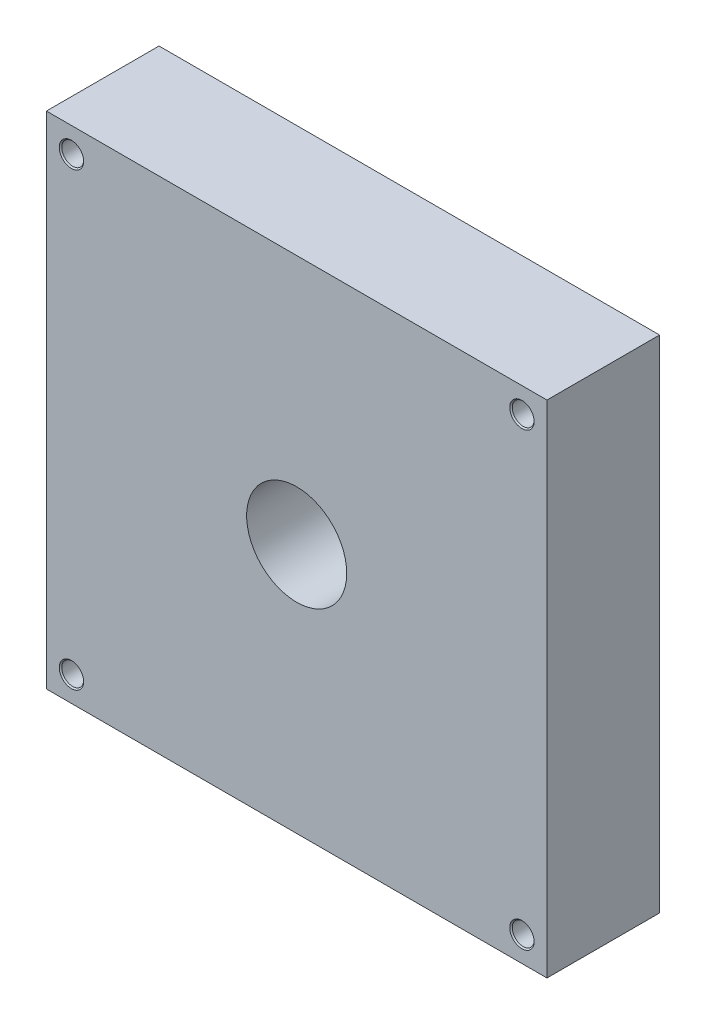
ISO-10303-21;
HEADER;
FILE_DESCRIPTION(('STEP AP214'),'2;1');
FILE_NAME('part.step','',(''),(''),'','','');
FILE_SCHEMA(('AUTOMOTIVE_DESIGN { 1 0 10303 214 1 1 1 1 }'));
ENDSEC;
DATA;
#1=APPLICATION_CONTEXT('core data for automotive mechanical design processes');
#2=APPLICATION_PROTOCOL_DEFINITION('international standard','automotive_design',2000,#1);
#3=PRODUCT_CONTEXT('',#1,'mechanical');
#4=PRODUCT('Part','Part','',(#3));
#5=PRODUCT_RELATED_PRODUCT_CATEGORY('part','',(#4));
#6=PRODUCT_DEFINITION_FORMATION('','',#4);
#7=PRODUCT_DEFINITION_CONTEXT('part definition',#1,'design');
#8=PRODUCT_DEFINITION('design','',#6,#7);
#9=PRODUCT_DEFINITION_SHAPE('','',#8);
#10=(LENGTH_UNIT() NAMED_UNIT(*) SI_UNIT(.MILLI.,.METRE.));
#11=(NAMED_UNIT(*) PLANE_ANGLE_UNIT() SI_UNIT($,.RADIAN.));
#12=(NAMED_UNIT(*) SI_UNIT($,.STERADIAN.) SOLID_ANGLE_UNIT());
#13=UNCERTAINTY_MEASURE_WITH_UNIT(LENGTH_MEASURE(1.E-05),#10,'distance_accuracy_value','');
#14=(GEOMETRIC_REPRESENTATION_CONTEXT(3) GLOBAL_UNCERTAINTY_ASSIGNED_CONTEXT((#13)) GLOBAL_UNIT_ASSIGNED_CONTEXT((#10,
#11,#12)) REPRESENTATION_CONTEXT('',''));
#15=CARTESIAN_POINT('',(0.,0.,0.));
#16=DIRECTION('',(0.,0.,1.));
#17=DIRECTION('',(1.,0.,0.));
#18=AXIS2_PLACEMENT_3D('',#15,#16,#17);
#19=CARTESIAN_POINT('',(-127.,0.,-57.15));
#20=DIRECTION('',(-1.,0.,0.));
#21=DIRECTION('',(0.,-1.,0.));
#22=AXIS2_PLACEMENT_3D('',#19,#20,#21);
#23=PLANE('',#22);
#24=DIRECTION('',(0.,-1.,0.));
#25=VECTOR('',#24,1.);
#26=CARTESIAN_POINT('',(-127.,0.,0.));
#27=LINE('',#26,#25);
#28=CARTESIAN_POINT('',(-127.,127.,0.));
#29=VERTEX_POINT('',#28);
#30=CARTESIAN_POINT('',(-127.,-127.,0.));
#31=VERTEX_POINT('',#30);
#32=EDGE_CURVE('E198',#29,#31,#27,.T.);
#33=ORIENTED_EDGE('',*,*,#32,.F.);
#34=DIRECTION('',(0.,0.,1.));
#35=VECTOR('',#34,1.);
#36=CARTESIAN_POINT('',(-127.,127.,-57.15));
#37=LINE('',#36,#35);
#38=CARTESIAN_POINT('',(-127.,127.,-57.15));
#39=VERTEX_POINT('',#38);
#40=EDGE_CURVE('E11',#39,#29,#37,.T.);
#41=ORIENTED_EDGE('',*,*,#40,.F.);
#42=DIRECTION('',(0.,-1.,0.));
#43=VECTOR('',#42,1.);
#44=CARTESIAN_POINT('',(-127.,0.,-57.15));
#45=LINE('',#44,#43);
#46=CARTESIAN_POINT('',(-127.,-127.,-57.15));
#47=VERTEX_POINT('',#46);
#48=EDGE_CURVE('E199',#39,#47,#45,.T.);
#49=ORIENTED_EDGE('',*,*,#48,.T.);
#50=DIRECTION('',(0.,0.,1.));
#51=VECTOR('',#50,1.);
#52=CARTESIAN_POINT('',(-127.,-127.,-57.15));
#53=LINE('',#52,#51);
#54=EDGE_CURVE('E39',#47,#31,#53,.T.);
#55=ORIENTED_EDGE('',*,*,#54,.T.);
#56=EDGE_LOOP('',(#33,#41,#49,#55));
#57=FACE_BOUND('',#56,.T.);
#58=ADVANCED_FACE('F36',(#57),#23,.T.);
#59=CARTESIAN_POINT('',(0.,127.,-57.15));
#60=DIRECTION('',(0.,1.,0.));
#61=DIRECTION('',(-1.,0.,0.));
#62=AXIS2_PLACEMENT_3D('',#59,#60,#61);
#63=PLANE('',#62);
#64=DIRECTION('',(-1.,0.,0.));
#65=VECTOR('',#64,1.);
#66=CARTESIAN_POINT('',(0.,127.,0.));
#67=LINE('',#66,#65);
#68=CARTESIAN_POINT('',(127.,127.,0.));
#69=VERTEX_POINT('',#68);
#70=EDGE_CURVE('E217',#69,#29,#67,.T.);
#71=ORIENTED_EDGE('',*,*,#70,.F.);
#72=DIRECTION('',(0.,0.,1.));
#73=VECTOR('',#72,1.);
#74=CARTESIAN_POINT('',(127.,127.,-57.15));
#75=LINE('',#74,#73);
#76=CARTESIAN_POINT('',(127.,127.,-57.15));
#77=VERTEX_POINT('',#76);
#78=EDGE_CURVE('E45',#77,#69,#75,.T.);
#79=ORIENTED_EDGE('',*,*,#78,.F.);
#80=DIRECTION('',(-1.,0.,0.));
#81=VECTOR('',#80,1.);
#82=CARTESIAN_POINT('',(0.,127.,-57.15));
#83=LINE('',#82,#81);
#84=EDGE_CURVE('E205',#77,#39,#83,.T.);
#85=ORIENTED_EDGE('',*,*,#84,.T.);
#86=ORIENTED_EDGE('',*,*,#40,.T.);
#87=EDGE_LOOP('',(#71,#79,#85,#86));
#88=FACE_BOUND('',#87,.T.);
#89=ADVANCED_FACE('F231',(#88),#63,.T.);
#90=CARTESIAN_POINT('',(127.,0.,-57.15));
#91=DIRECTION('',(-1.,0.,0.));
#92=DIRECTION('',(0.,-1.,0.));
#93=AXIS2_PLACEMENT_3D('',#90,#91,#92);
#94=PLANE('',#93);
#95=DIRECTION('',(0.,-1.,0.));
#96=VECTOR('',#95,1.);
#97=CARTESIAN_POINT('',(127.,0.,0.));
#98=LINE('',#97,#96);
#99=CARTESIAN_POINT('',(127.,-127.,0.));
#100=VERTEX_POINT('',#99);
#101=EDGE_CURVE('E215',#69,#100,#98,.T.);
#102=ORIENTED_EDGE('',*,*,#101,.T.);
#103=DIRECTION('',(0.,0.,1.));
#104=VECTOR('',#103,1.);
#105=CARTESIAN_POINT('',(127.,-127.,-57.15));
#106=LINE('',#105,#104);
#107=CARTESIAN_POINT('',(127.,-127.,-57.15));
#108=VERTEX_POINT('',#107);
#109=EDGE_CURVE('E222',#108,#100,#106,.T.);
#110=ORIENTED_EDGE('',*,*,#109,.F.);
#111=DIRECTION('',(0.,-1.,0.));
#112=VECTOR('',#111,1.);
#113=CARTESIAN_POINT('',(127.,0.,-57.15));
#114=LINE('',#113,#112);
#115=EDGE_CURVE('E203',#77,#108,#114,.T.);
#116=ORIENTED_EDGE('',*,*,#115,.F.);
#117=ORIENTED_EDGE('',*,*,#78,.T.);
#118=EDGE_LOOP('',(#102,#110,#116,#117));
#119=FACE_BOUND('',#118,.T.);
#120=ADVANCED_FACE('F233',(#119),#94,.F.);
#121=CARTESIAN_POINT('',(0.,-127.,-57.15));
#122=DIRECTION('',(0.,1.,0.));
#123=DIRECTION('',(-1.,0.,0.));
#124=AXIS2_PLACEMENT_3D('',#121,#122,#123);
#125=PLANE('',#124);
#126=CARTESIAN_POINT('',(-3.17499999999994,-127.,-25.4));
#127=DIRECTION('',(0.,-1.,0.));
#128=DIRECTION('',(0.,0.,-1.));
#129=AXIS2_PLACEMENT_3D('',#126,#127,#128);
#130=CIRCLE('',#129,2.01929999999999);
#131=CARTESIAN_POINT('',(-3.17499999999994,-127.,-27.4193));
#132=VERTEX_POINT('',#131);
#133=EDGE_CURVE('E104',#132,#132,#130,.T.);
#134=ORIENTED_EDGE('',*,*,#133,.F.);
#135=EDGE_LOOP('',(#134));
#136=FACE_BOUND('',#135,.T.);
#137=CARTESIAN_POINT('',(9.52500000000006,-127.,-25.4));
#138=DIRECTION('',(0.,-1.,0.));
#139=DIRECTION('',(0.,0.,-1.));
#140=AXIS2_PLACEMENT_3D('',#137,#138,#139);
#141=CIRCLE('',#140,2.01929999999999);
#142=CARTESIAN_POINT('',(9.52500000000006,-127.,-27.4193));
#143=VERTEX_POINT('',#142);
#144=EDGE_CURVE('E103',#143,#143,#141,.T.);
#145=ORIENTED_EDGE('',*,*,#144,.F.);
#146=EDGE_LOOP('',(#145));
#147=FACE_BOUND('',#146,.T.);
#148=CARTESIAN_POINT('',(-36.9999999999999,-127.,-14.2875));
#149=DIRECTION('',(0.,-1.,0.));
#150=DIRECTION('',(0.,0.,-1.));
#151=AXIS2_PLACEMENT_3D('',#148,#149,#150);
#152=CIRCLE('',#151,2.01929999999999);
#153=CARTESIAN_POINT('',(-36.9999999999999,-127.,-16.3068));
#154=VERTEX_POINT('',#153);
#155=EDGE_CURVE('E114',#154,#154,#152,.T.);
#156=ORIENTED_EDGE('',*,*,#155,.F.);
#157=EDGE_LOOP('',(#156));
#158=FACE_BOUND('',#157,.T.);
#159=CARTESIAN_POINT('',(-36.9999999999999,-127.,-36.5125));
#160=DIRECTION('',(0.,-1.,0.));
#161=DIRECTION('',(0.,0.,-1.));
#162=AXIS2_PLACEMENT_3D('',#159,#160,#161);
#163=CIRCLE('',#162,2.01929999999999);
#164=CARTESIAN_POINT('',(-36.9999999999999,-127.,-38.5318));
#165=VERTEX_POINT('',#164);
#166=EDGE_CURVE('E120',#165,#165,#163,.T.);
#167=ORIENTED_EDGE('',*,*,#166,.F.);
#168=EDGE_LOOP('',(#167));
#169=FACE_BOUND('',#168,.T.);
#170=DIRECTION('',(-1.,0.,0.));
#171=VECTOR('',#170,1.);
#172=CARTESIAN_POINT('',(0.,-127.,0.));
#173=LINE('',#172,#171);
#174=EDGE_CURVE('E212',#100,#31,#173,.T.);
#175=ORIENTED_EDGE('',*,*,#174,.T.);
#176=ORIENTED_EDGE('',*,*,#54,.F.);
#177=DIRECTION('',(-1.,0.,0.));
#178=VECTOR('',#177,1.);
#179=CARTESIAN_POINT('',(0.,-127.,-57.15));
#180=LINE('',#179,#178);
#181=EDGE_CURVE('E79',#108,#47,#180,.T.);
#182=ORIENTED_EDGE('',*,*,#181,.F.);
#183=ORIENTED_EDGE('',*,*,#109,.T.);
#184=EDGE_LOOP('',(#175,#176,#182,#183));
#185=FACE_BOUND('',#184,.T.);
#186=ADVANCED_FACE('F227',(#136,#147,#158,#169,#185),#125,.F.);
#187=CARTESIAN_POINT('',(0.,0.,-57.15));
#188=DIRECTION('',(0.,0.,1.));
#189=DIRECTION('',(1.,0.,0.));
#190=AXIS2_PLACEMENT_3D('',#187,#188,#189);
#191=CYLINDRICAL_SURFACE('',#190,25.4);
#192=CARTESIAN_POINT('',(0.,0.,-57.15));
#193=DIRECTION('',(0.,0.,1.));
#194=DIRECTION('',(1.,0.,0.));
#195=AXIS2_PLACEMENT_3D('',#192,#193,#194);
#196=CIRCLE('',#195,25.4);
#197=CARTESIAN_POINT('',(25.4,0.,-57.15));
#198=VERTEX_POINT('',#197);
#199=EDGE_CURVE('E207',#198,#198,#196,.T.);
#200=ORIENTED_EDGE('',*,*,#199,.F.);
#201=EDGE_LOOP('',(#200));
#202=FACE_BOUND('',#201,.T.);
#203=CARTESIAN_POINT('',(0.,0.,0.));
#204=DIRECTION('',(0.,0.,1.));
#205=DIRECTION('',(1.,0.,0.));
#206=AXIS2_PLACEMENT_3D('',#203,#204,#205);
#207=CIRCLE('',#206,25.4);
#208=CARTESIAN_POINT('',(25.4,0.,0.));
#209=VERTEX_POINT('',#208);
#210=EDGE_CURVE('E201',#209,#209,#207,.T.);
#211=ORIENTED_EDGE('',*,*,#210,.T.);
#212=EDGE_LOOP('',(#211));
#213=FACE_BOUND('',#212,.T.);
#214=ADVANCED_FACE('F237',(#202,#213),#191,.F.);
#215=CARTESIAN_POINT('',(0.,0.,-57.15));
#216=DIRECTION('',(0.,0.,1.));
#217=DIRECTION('',(1.,0.,0.));
#218=AXIS2_PLACEMENT_3D('',#215,#216,#217);
#219=PLANE('',#218);
#220=CARTESIAN_POINT('',(-114.3,114.3,-57.15));
#221=DIRECTION('',(0.,0.,1.));
#222=DIRECTION('',(1.,0.,0.));
#223=AXIS2_PLACEMENT_3D('',#220,#221,#222);
#224=CIRCLE('',#223,3.89889999999998);
#225=CARTESIAN_POINT('',(-110.4011,114.3,-57.15));
#226=VERTEX_POINT('',#225);
#227=EDGE_CURVE('E126',#226,#226,#224,.T.);
#228=ORIENTED_EDGE('',*,*,#227,.T.);
#229=EDGE_LOOP('',(#228));
#230=FACE_BOUND('',#229,.T.);
#231=CARTESIAN_POINT('',(114.3,114.3,-57.15));
#232=DIRECTION('',(0.,0.,1.));
#233=DIRECTION('',(1.,0.,0.));
#234=AXIS2_PLACEMENT_3D('',#231,#232,#233);
#235=CIRCLE('',#234,3.89889999999998);
#236=CARTESIAN_POINT('',(118.1989,114.3,-57.15));
#237=VERTEX_POINT('',#236);
#238=EDGE_CURVE('E144',#237,#237,#235,.T.);
#239=ORIENTED_EDGE('',*,*,#238,.T.);
#240=EDGE_LOOP('',(#239));
#241=FACE_BOUND('',#240,.T.);
#242=CARTESIAN_POINT('',(114.3,-114.3,-57.15));
#243=DIRECTION('',(0.,0.,1.));
#244=DIRECTION('',(1.,0.,0.));
#245=AXIS2_PLACEMENT_3D('',#242,#243,#244);
#246=CIRCLE('',#245,3.89889999999998);
#247=CARTESIAN_POINT('',(118.1989,-114.3,-57.15));
#248=VERTEX_POINT('',#247);
#249=EDGE_CURVE('E162',#248,#248,#246,.T.);
#250=ORIENTED_EDGE('',*,*,#249,.T.);
#251=EDGE_LOOP('',(#250));
#252=FACE_BOUND('',#251,.T.);
#253=CARTESIAN_POINT('',(-114.3,-114.3,-57.15));
#254=DIRECTION('',(0.,0.,1.));
#255=DIRECTION('',(1.,0.,0.));
#256=AXIS2_PLACEMENT_3D('',#253,#254,#255);
#257=CIRCLE('',#256,3.89889999999998);
#258=CARTESIAN_POINT('',(-110.4011,-114.3,-57.15));
#259=VERTEX_POINT('',#258);
#260=EDGE_CURVE('E180',#259,#259,#257,.T.);
#261=ORIENTED_EDGE('',*,*,#260,.T.);
#262=EDGE_LOOP('',(#261));
#263=FACE_BOUND('',#262,.T.);
#264=ORIENTED_EDGE('',*,*,#48,.F.);
#265=ORIENTED_EDGE('',*,*,#84,.F.);
#266=ORIENTED_EDGE('',*,*,#115,.T.);
#267=ORIENTED_EDGE('',*,*,#181,.T.);
#268=EDGE_LOOP('',(#264,#265,#266,#267));
#269=FACE_BOUND('',#268,.T.);
#270=ORIENTED_EDGE('',*,*,#199,.T.);
#271=EDGE_LOOP('',(#270));
#272=FACE_BOUND('',#271,.T.);
#273=ADVANCED_FACE('F234',(#230,#241,#252,#263,#269,#272),#219,.F.);
#274=CARTESIAN_POINT('',(0.,0.,0.));
#275=DIRECTION('',(0.,0.,1.));
#276=DIRECTION('',(1.,0.,0.));
#277=AXIS2_PLACEMENT_3D('',#274,#275,#276);
#278=PLANE('',#277);
#279=CARTESIAN_POINT('',(-114.3,114.3,0.));
#280=DIRECTION('',(0.,0.,1.));
#281=DIRECTION('',(1.,0.,0.));
#282=AXIS2_PLACEMENT_3D('',#279,#280,#281);
#283=CIRCLE('',#282,6.19125);
#284=CARTESIAN_POINT('',(-108.10875,114.3,0.));
#285=VERTEX_POINT('',#284);
#286=EDGE_CURVE('E129',#285,#285,#283,.T.);
#287=ORIENTED_EDGE('',*,*,#286,.F.);
#288=EDGE_LOOP('',(#287));
#289=FACE_BOUND('',#288,.T.);
#290=CARTESIAN_POINT('',(114.3,114.3,0.));
#291=DIRECTION('',(0.,0.,1.));
#292=DIRECTION('',(1.,0.,0.));
#293=AXIS2_PLACEMENT_3D('',#290,#291,#292);
#294=CIRCLE('',#293,6.19125);
#295=CARTESIAN_POINT('',(120.49125,114.3,0.));
#296=VERTEX_POINT('',#295);
#297=EDGE_CURVE('E147',#296,#296,#294,.T.);
#298=ORIENTED_EDGE('',*,*,#297,.F.);
#299=EDGE_LOOP('',(#298));
#300=FACE_BOUND('',#299,.T.);
#301=CARTESIAN_POINT('',(114.3,-114.3,0.));
#302=DIRECTION('',(0.,0.,1.));
#303=DIRECTION('',(1.,0.,0.));
#304=AXIS2_PLACEMENT_3D('',#301,#302,#303);
#305=CIRCLE('',#304,6.19125);
#306=CARTESIAN_POINT('',(120.49125,-114.3,0.));
#307=VERTEX_POINT('',#306);
#308=EDGE_CURVE('E165',#307,#307,#305,.T.);
#309=ORIENTED_EDGE('',*,*,#308,.F.);
#310=EDGE_LOOP('',(#309));
#311=FACE_BOUND('',#310,.T.);
#312=CARTESIAN_POINT('',(-114.3,-114.3,0.));
#313=DIRECTION('',(0.,0.,1.));
#314=DIRECTION('',(1.,0.,0.));
#315=AXIS2_PLACEMENT_3D('',#312,#313,#314);
#316=CIRCLE('',#315,6.19125);
#317=CARTESIAN_POINT('',(-108.10875,-114.3,0.));
#318=VERTEX_POINT('',#317);
#319=EDGE_CURVE('E183',#318,#318,#316,.T.);
#320=ORIENTED_EDGE('',*,*,#319,.F.);
#321=EDGE_LOOP('',(#320));
#322=FACE_BOUND('',#321,.T.);
#323=ORIENTED_EDGE('',*,*,#32,.T.);
#324=ORIENTED_EDGE('',*,*,#174,.F.);
#325=ORIENTED_EDGE('',*,*,#101,.F.);
#326=ORIENTED_EDGE('',*,*,#70,.T.);
#327=EDGE_LOOP('',(#323,#324,#325,#326));
#328=FACE_BOUND('',#327,.T.);
#329=ORIENTED_EDGE('',*,*,#210,.F.);
#330=EDGE_LOOP('',(#329));
#331=FACE_BOUND('',#330,.T.);
#332=ADVANCED_FACE('F229',(#289,#300,#311,#322,#328,#331),#278,.T.);
#333=CARTESIAN_POINT('',(-114.3,-114.3,-56.515));
#334=DIRECTION('',(0.,0.,-1.));
#335=DIRECTION('',(-1.,0.,0.));
#336=AXIS2_PLACEMENT_3D('',#333,#334,#335);
#337=CONICAL_SURFACE('',#336,3.26389999999999,0.785398163397454);
#338=ORIENTED_EDGE('',*,*,#260,.F.);
#339=EDGE_LOOP('',(#338));
#340=FACE_BOUND('',#339,.T.);
#341=CARTESIAN_POINT('',(-114.3,-114.3,-56.515));
#342=DIRECTION('',(0.,0.,1.));
#343=DIRECTION('',(1.,0.,0.));
#344=AXIS2_PLACEMENT_3D('',#341,#342,#343);
#345=CIRCLE('',#344,3.26389999999999);
#346=CARTESIAN_POINT('',(-111.0361,-114.3,-56.515));
#347=VERTEX_POINT('',#346);
#348=EDGE_CURVE('E195',#347,#347,#345,.T.);
#349=ORIENTED_EDGE('',*,*,#348,.T.);
#350=EDGE_LOOP('',(#349));
#351=FACE_BOUND('',#350,.T.);
#352=ADVANCED_FACE('F247',(#340,#351),#337,.F.);
#353=CARTESIAN_POINT('',(-114.3,-114.3,0.));
#354=DIRECTION('',(0.,0.,1.));
#355=DIRECTION('',(1.,0.,0.));
#356=AXIS2_PLACEMENT_3D('',#353,#354,#355);
#357=CYLINDRICAL_SURFACE('',#356,3.26389999999999);
#358=ORIENTED_EDGE('',*,*,#348,.F.);
#359=EDGE_LOOP('',(#358));
#360=FACE_BOUND('',#359,.T.);
#361=CARTESIAN_POINT('',(-114.3,-114.3,-50.8));
#362=DIRECTION('',(0.,0.,1.));
#363=DIRECTION('',(1.,0.,0.));
#364=AXIS2_PLACEMENT_3D('',#361,#362,#363);
#365=CIRCLE('',#364,3.26389999999999);
#366=CARTESIAN_POINT('',(-111.0361,-114.3,-50.8));
#367=VERTEX_POINT('',#366);
#368=EDGE_CURVE('E192',#367,#367,#365,.T.);
#369=ORIENTED_EDGE('',*,*,#368,.T.);
#370=EDGE_LOOP('',(#369));
#371=FACE_BOUND('',#370,.T.);
#372=ADVANCED_FACE('F253',(#360,#371),#357,.F.);
#373=CARTESIAN_POINT('',(-108.74375,-114.3,-50.8));
#374=DIRECTION('',(0.,0.,-1.));
#375=DIRECTION('',(-1.,0.,0.));
#376=AXIS2_PLACEMENT_3D('',#373,#374,#375);
#377=PLANE('',#376);
#378=ORIENTED_EDGE('',*,*,#368,.F.);
#379=EDGE_LOOP('',(#378));
#380=FACE_BOUND('',#379,.T.);
#381=CARTESIAN_POINT('',(-114.3,-114.3,-50.8));
#382=DIRECTION('',(0.,0.,1.));
#383=DIRECTION('',(1.,0.,0.));
#384=AXIS2_PLACEMENT_3D('',#381,#382,#383);
#385=CIRCLE('',#384,5.55624999999998);
#386=CARTESIAN_POINT('',(-108.74375,-114.3,-50.8));
#387=VERTEX_POINT('',#386);
#388=EDGE_CURVE('E189',#387,#387,#385,.T.);
#389=ORIENTED_EDGE('',*,*,#388,.T.);
#390=EDGE_LOOP('',(#389));
#391=FACE_BOUND('',#390,.T.);
#392=ADVANCED_FACE('F364',(#380,#391),#377,.F.);
#393=CARTESIAN_POINT('',(-114.3,-114.3,0.));
#394=DIRECTION('',(0.,0.,1.));
#395=DIRECTION('',(1.,0.,0.));
#396=AXIS2_PLACEMENT_3D('',#393,#394,#395);
#397=CYLINDRICAL_SURFACE('',#396,5.55624999999999);
#398=ORIENTED_EDGE('',*,*,#388,.F.);
#399=EDGE_LOOP('',(#398));
#400=FACE_BOUND('',#399,.T.);
#401=CARTESIAN_POINT('',(-114.3,-114.3,-0.635));
#402=DIRECTION('',(0.,0.,1.));
#403=DIRECTION('',(1.,0.,0.));
#404=AXIS2_PLACEMENT_3D('',#401,#402,#403);
#405=CIRCLE('',#404,5.55625);
#406=CARTESIAN_POINT('',(-108.74375,-114.3,-0.635));
#407=VERTEX_POINT('',#406);
#408=EDGE_CURVE('E186',#407,#407,#405,.T.);
#409=ORIENTED_EDGE('',*,*,#408,.T.);
#410=EDGE_LOOP('',(#409));
#411=FACE_BOUND('',#410,.T.);
#412=ADVANCED_FACE('F360',(#400,#411),#397,.F.);
#413=CARTESIAN_POINT('',(-114.3,-114.3,0.));
#414=DIRECTION('',(0.,0.,1.));
#415=DIRECTION('',(1.,0.,0.));
#416=AXIS2_PLACEMENT_3D('',#413,#414,#415);
#417=CONICAL_SURFACE('',#416,6.19125,0.785398163397445);
#418=ORIENTED_EDGE('',*,*,#408,.F.);
#419=EDGE_LOOP('',(#418));
#420=FACE_BOUND('',#419,.T.);
#421=ORIENTED_EDGE('',*,*,#319,.T.);
#422=EDGE_LOOP('',(#421));
#423=FACE_BOUND('',#422,.T.);
#424=ADVANCED_FACE('F356',(#420,#423),#417,.F.);
#425=CARTESIAN_POINT('',(114.3,-114.3,-56.515));
#426=DIRECTION('',(0.,0.,-1.));
#427=DIRECTION('',(-1.,0.,0.));
#428=AXIS2_PLACEMENT_3D('',#425,#426,#427);
#429=CONICAL_SURFACE('',#428,3.26389999999999,0.785398163397454);
#430=ORIENTED_EDGE('',*,*,#249,.F.);
#431=EDGE_LOOP('',(#430));
#432=FACE_BOUND('',#431,.T.);
#433=CARTESIAN_POINT('',(114.3,-114.3,-56.515));
#434=DIRECTION('',(0.,0.,1.));
#435=DIRECTION('',(1.,0.,0.));
#436=AXIS2_PLACEMENT_3D('',#433,#434,#435);
#437=CIRCLE('',#436,3.26389999999999);
#438=CARTESIAN_POINT('',(117.5639,-114.3,-56.515));
#439=VERTEX_POINT('',#438);
#440=EDGE_CURVE('E177',#439,#439,#437,.T.);
#441=ORIENTED_EDGE('',*,*,#440,.T.);
#442=EDGE_LOOP('',(#441));
#443=FACE_BOUND('',#442,.T.);
#444=ADVANCED_FACE('F352',(#432,#443),#429,.F.);
#445=CARTESIAN_POINT('',(114.3,-114.3,0.));
#446=DIRECTION('',(0.,0.,1.));
#447=DIRECTION('',(1.,0.,0.));
#448=AXIS2_PLACEMENT_3D('',#445,#446,#447);
#449=CYLINDRICAL_SURFACE('',#448,3.26389999999999);
#450=ORIENTED_EDGE('',*,*,#440,.F.);
#451=EDGE_LOOP('',(#450));
#452=FACE_BOUND('',#451,.T.);
#453=CARTESIAN_POINT('',(114.3,-114.3,-50.8));
#454=DIRECTION('',(0.,0.,1.));
#455=DIRECTION('',(1.,0.,0.));
#456=AXIS2_PLACEMENT_3D('',#453,#454,#455);
#457=CIRCLE('',#456,3.26389999999999);
#458=CARTESIAN_POINT('',(117.5639,-114.3,-50.8));
#459=VERTEX_POINT('',#458);
#460=EDGE_CURVE('E174',#459,#459,#457,.T.);
#461=ORIENTED_EDGE('',*,*,#460,.T.);
#462=EDGE_LOOP('',(#461));
#463=FACE_BOUND('',#462,.T.);
#464=ADVANCED_FACE('F348',(#452,#463),#449,.F.);
#465=CARTESIAN_POINT('',(119.85625,-114.3,-50.8));
#466=DIRECTION('',(0.,0.,-1.));
#467=DIRECTION('',(-1.,0.,0.));
#468=AXIS2_PLACEMENT_3D('',#465,#466,#467);
#469=PLANE('',#468);
#470=ORIENTED_EDGE('',*,*,#460,.F.);
#471=EDGE_LOOP('',(#470));
#472=FACE_BOUND('',#471,.T.);
#473=CARTESIAN_POINT('',(114.3,-114.3,-50.8));
#474=DIRECTION('',(0.,0.,1.));
#475=DIRECTION('',(1.,0.,0.));
#476=AXIS2_PLACEMENT_3D('',#473,#474,#475);
#477=CIRCLE('',#476,5.55624999999998);
#478=CARTESIAN_POINT('',(119.85625,-114.3,-50.8));
#479=VERTEX_POINT('',#478);
#480=EDGE_CURVE('E171',#479,#479,#477,.T.);
#481=ORIENTED_EDGE('',*,*,#480,.T.);
#482=EDGE_LOOP('',(#481));
#483=FACE_BOUND('',#482,.T.);
#484=ADVANCED_FACE('F344',(#472,#483),#469,.F.);
#485=CARTESIAN_POINT('',(114.3,-114.3,0.));
#486=DIRECTION('',(0.,0.,1.));
#487=DIRECTION('',(1.,0.,0.));
#488=AXIS2_PLACEMENT_3D('',#485,#486,#487);
#489=CYLINDRICAL_SURFACE('',#488,5.55624999999999);
#490=ORIENTED_EDGE('',*,*,#480,.F.);
#491=EDGE_LOOP('',(#490));
#492=FACE_BOUND('',#491,.T.);
#493=CARTESIAN_POINT('',(114.3,-114.3,-0.635));
#494=DIRECTION('',(0.,0.,1.));
#495=DIRECTION('',(1.,0.,0.));
#496=AXIS2_PLACEMENT_3D('',#493,#494,#495);
#497=CIRCLE('',#496,5.55625);
#498=CARTESIAN_POINT('',(119.85625,-114.3,-0.635));
#499=VERTEX_POINT('',#498);
#500=EDGE_CURVE('E168',#499,#499,#497,.T.);
#501=ORIENTED_EDGE('',*,*,#500,.T.);
#502=EDGE_LOOP('',(#501));
#503=FACE_BOUND('',#502,.T.);
#504=ADVANCED_FACE('F340',(#492,#503),#489,.F.);
#505=CARTESIAN_POINT('',(114.3,-114.3,0.));
#506=DIRECTION('',(0.,0.,1.));
#507=DIRECTION('',(1.,0.,0.));
#508=AXIS2_PLACEMENT_3D('',#505,#506,#507);
#509=CONICAL_SURFACE('',#508,6.19125,0.785398163397445);
#510=ORIENTED_EDGE('',*,*,#500,.F.);
#511=EDGE_LOOP('',(#510));
#512=FACE_BOUND('',#511,.T.);
#513=ORIENTED_EDGE('',*,*,#308,.T.);
#514=EDGE_LOOP('',(#513));
#515=FACE_BOUND('',#514,.T.);
#516=ADVANCED_FACE('F336',(#512,#515),#509,.F.);
#517=CARTESIAN_POINT('',(114.3,114.3,-56.515));
#518=DIRECTION('',(0.,0.,-1.));
#519=DIRECTION('',(-1.,0.,0.));
#520=AXIS2_PLACEMENT_3D('',#517,#518,#519);
#521=CONICAL_SURFACE('',#520,3.26389999999999,0.785398163397454);
#522=ORIENTED_EDGE('',*,*,#238,.F.);
#523=EDGE_LOOP('',(#522));
#524=FACE_BOUND('',#523,.T.);
#525=CARTESIAN_POINT('',(114.3,114.3,-56.515));
#526=DIRECTION('',(0.,0.,1.));
#527=DIRECTION('',(1.,0.,0.));
#528=AXIS2_PLACEMENT_3D('',#525,#526,#527);
#529=CIRCLE('',#528,3.26389999999999);
#530=CARTESIAN_POINT('',(117.5639,114.3,-56.515));
#531=VERTEX_POINT('',#530);
#532=EDGE_CURVE('E159',#531,#531,#529,.T.);
#533=ORIENTED_EDGE('',*,*,#532,.T.);
#534=EDGE_LOOP('',(#533));
#535=FACE_BOUND('',#534,.T.);
#536=ADVANCED_FACE('F332',(#524,#535),#521,.F.);
#537=CARTESIAN_POINT('',(114.3,114.3,0.));
#538=DIRECTION('',(0.,0.,1.));
#539=DIRECTION('',(1.,0.,0.));
#540=AXIS2_PLACEMENT_3D('',#537,#538,#539);
#541=CYLINDRICAL_SURFACE('',#540,3.26389999999999);
#542=ORIENTED_EDGE('',*,*,#532,.F.);
#543=EDGE_LOOP('',(#542));
#544=FACE_BOUND('',#543,.T.);
#545=CARTESIAN_POINT('',(114.3,114.3,-50.8));
#546=DIRECTION('',(0.,0.,1.));
#547=DIRECTION('',(1.,0.,0.));
#548=AXIS2_PLACEMENT_3D('',#545,#546,#547);
#549=CIRCLE('',#548,3.26389999999999);
#550=CARTESIAN_POINT('',(117.5639,114.3,-50.8));
#551=VERTEX_POINT('',#550);
#552=EDGE_CURVE('E156',#551,#551,#549,.T.);
#553=ORIENTED_EDGE('',*,*,#552,.T.);
#554=EDGE_LOOP('',(#553));
#555=FACE_BOUND('',#554,.T.);
#556=ADVANCED_FACE('F328',(#544,#555),#541,.F.);
#557=CARTESIAN_POINT('',(119.85625,114.3,-50.8));
#558=DIRECTION('',(0.,0.,-1.));
#559=DIRECTION('',(-1.,0.,0.));
#560=AXIS2_PLACEMENT_3D('',#557,#558,#559);
#561=PLANE('',#560);
#562=ORIENTED_EDGE('',*,*,#552,.F.);
#563=EDGE_LOOP('',(#562));
#564=FACE_BOUND('',#563,.T.);
#565=CARTESIAN_POINT('',(114.3,114.3,-50.8));
#566=DIRECTION('',(0.,0.,1.));
#567=DIRECTION('',(1.,0.,0.));
#568=AXIS2_PLACEMENT_3D('',#565,#566,#567);
#569=CIRCLE('',#568,5.55624999999998);
#570=CARTESIAN_POINT('',(119.85625,114.3,-50.8));
#571=VERTEX_POINT('',#570);
#572=EDGE_CURVE('E153',#571,#571,#569,.T.);
#573=ORIENTED_EDGE('',*,*,#572,.T.);
#574=EDGE_LOOP('',(#573));
#575=FACE_BOUND('',#574,.T.);
#576=ADVANCED_FACE('F324',(#564,#575),#561,.F.);
#577=CARTESIAN_POINT('',(114.3,114.3,0.));
#578=DIRECTION('',(0.,0.,1.));
#579=DIRECTION('',(1.,0.,0.));
#580=AXIS2_PLACEMENT_3D('',#577,#578,#579);
#581=CYLINDRICAL_SURFACE('',#580,5.55624999999999);
#582=ORIENTED_EDGE('',*,*,#572,.F.);
#583=EDGE_LOOP('',(#582));
#584=FACE_BOUND('',#583,.T.);
#585=CARTESIAN_POINT('',(114.3,114.3,-0.635));
#586=DIRECTION('',(0.,0.,1.));
#587=DIRECTION('',(1.,0.,0.));
#588=AXIS2_PLACEMENT_3D('',#585,#586,#587);
#589=CIRCLE('',#588,5.55625);
#590=CARTESIAN_POINT('',(119.85625,114.3,-0.635));
#591=VERTEX_POINT('',#590);
#592=EDGE_CURVE('E150',#591,#591,#589,.T.);
#593=ORIENTED_EDGE('',*,*,#592,.T.);
#594=EDGE_LOOP('',(#593));
#595=FACE_BOUND('',#594,.T.);
#596=ADVANCED_FACE('F320',(#584,#595),#581,.F.);
#597=CARTESIAN_POINT('',(114.3,114.3,0.));
#598=DIRECTION('',(0.,0.,1.));
#599=DIRECTION('',(1.,0.,0.));
#600=AXIS2_PLACEMENT_3D('',#597,#598,#599);
#601=CONICAL_SURFACE('',#600,6.19125,0.785398163397445);
#602=ORIENTED_EDGE('',*,*,#592,.F.);
#603=EDGE_LOOP('',(#602));
#604=FACE_BOUND('',#603,.T.);
#605=ORIENTED_EDGE('',*,*,#297,.T.);
#606=EDGE_LOOP('',(#605));
#607=FACE_BOUND('',#606,.T.);
#608=ADVANCED_FACE('F316',(#604,#607),#601,.F.);
#609=CARTESIAN_POINT('',(-114.3,114.3,-56.515));
#610=DIRECTION('',(0.,0.,-1.));
#611=DIRECTION('',(-1.,0.,0.));
#612=AXIS2_PLACEMENT_3D('',#609,#610,#611);
#613=CONICAL_SURFACE('',#612,3.26389999999999,0.785398163397454);
#614=ORIENTED_EDGE('',*,*,#227,.F.);
#615=EDGE_LOOP('',(#614));
#616=FACE_BOUND('',#615,.T.);
#617=CARTESIAN_POINT('',(-114.3,114.3,-56.515));
#618=DIRECTION('',(0.,0.,1.));
#619=DIRECTION('',(1.,0.,0.));
#620=AXIS2_PLACEMENT_3D('',#617,#618,#619);
#621=CIRCLE('',#620,3.26389999999999);
#622=CARTESIAN_POINT('',(-111.0361,114.3,-56.515));
#623=VERTEX_POINT('',#622);
#624=EDGE_CURVE('E141',#623,#623,#621,.T.);
#625=ORIENTED_EDGE('',*,*,#624,.T.);
#626=EDGE_LOOP('',(#625));
#627=FACE_BOUND('',#626,.T.);
#628=ADVANCED_FACE('F312',(#616,#627),#613,.F.);
#629=CARTESIAN_POINT('',(-114.3,114.3,0.));
#630=DIRECTION('',(0.,0.,1.));
#631=DIRECTION('',(1.,0.,0.));
#632=AXIS2_PLACEMENT_3D('',#629,#630,#631);
#633=CYLINDRICAL_SURFACE('',#632,3.26389999999999);
#634=ORIENTED_EDGE('',*,*,#624,.F.);
#635=EDGE_LOOP('',(#634));
#636=FACE_BOUND('',#635,.T.);
#637=CARTESIAN_POINT('',(-114.3,114.3,-50.8));
#638=DIRECTION('',(0.,0.,1.));
#639=DIRECTION('',(1.,0.,0.));
#640=AXIS2_PLACEMENT_3D('',#637,#638,#639);
#641=CIRCLE('',#640,3.26389999999999);
#642=CARTESIAN_POINT('',(-111.0361,114.3,-50.8));
#643=VERTEX_POINT('',#642);
#644=EDGE_CURVE('E138',#643,#643,#641,.T.);
#645=ORIENTED_EDGE('',*,*,#644,.T.);
#646=EDGE_LOOP('',(#645));
#647=FACE_BOUND('',#646,.T.);
#648=ADVANCED_FACE('F308',(#636,#647),#633,.F.);
#649=CARTESIAN_POINT('',(-108.74375,114.3,-50.8));
#650=DIRECTION('',(0.,0.,-1.));
#651=DIRECTION('',(-1.,0.,0.));
#652=AXIS2_PLACEMENT_3D('',#649,#650,#651);
#653=PLANE('',#652);
#654=ORIENTED_EDGE('',*,*,#644,.F.);
#655=EDGE_LOOP('',(#654));
#656=FACE_BOUND('',#655,.T.);
#657=CARTESIAN_POINT('',(-114.3,114.3,-50.8));
#658=DIRECTION('',(0.,0.,1.));
#659=DIRECTION('',(1.,0.,0.));
#660=AXIS2_PLACEMENT_3D('',#657,#658,#659);
#661=CIRCLE('',#660,5.55624999999998);
#662=CARTESIAN_POINT('',(-108.74375,114.3,-50.8));
#663=VERTEX_POINT('',#662);
#664=EDGE_CURVE('E135',#663,#663,#661,.T.);
#665=ORIENTED_EDGE('',*,*,#664,.T.);
#666=EDGE_LOOP('',(#665));
#667=FACE_BOUND('',#666,.T.);
#668=ADVANCED_FACE('F304',(#656,#667),#653,.F.);
#669=CARTESIAN_POINT('',(-114.3,114.3,0.));
#670=DIRECTION('',(0.,0.,1.));
#671=DIRECTION('',(1.,0.,0.));
#672=AXIS2_PLACEMENT_3D('',#669,#670,#671);
#673=CYLINDRICAL_SURFACE('',#672,5.55624999999999);
#674=ORIENTED_EDGE('',*,*,#664,.F.);
#675=EDGE_LOOP('',(#674));
#676=FACE_BOUND('',#675,.T.);
#677=CARTESIAN_POINT('',(-114.3,114.3,-0.635));
#678=DIRECTION('',(0.,0.,1.));
#679=DIRECTION('',(1.,0.,0.));
#680=AXIS2_PLACEMENT_3D('',#677,#678,#679);
#681=CIRCLE('',#680,5.55625);
#682=CARTESIAN_POINT('',(-108.74375,114.3,-0.635));
#683=VERTEX_POINT('',#682);
#684=EDGE_CURVE('E132',#683,#683,#681,.T.);
#685=ORIENTED_EDGE('',*,*,#684,.T.);
#686=EDGE_LOOP('',(#685));
#687=FACE_BOUND('',#686,.T.);
#688=ADVANCED_FACE('F300',(#676,#687),#673,.F.);
#689=CARTESIAN_POINT('',(-114.3,114.3,0.));
#690=DIRECTION('',(0.,0.,1.));
#691=DIRECTION('',(1.,0.,0.));
#692=AXIS2_PLACEMENT_3D('',#689,#690,#691);
#693=CONICAL_SURFACE('',#692,6.19125,0.785398163397445);
#694=ORIENTED_EDGE('',*,*,#684,.F.);
#695=EDGE_LOOP('',(#694));
#696=FACE_BOUND('',#695,.T.);
#697=ORIENTED_EDGE('',*,*,#286,.T.);
#698=EDGE_LOOP('',(#697));
#699=FACE_BOUND('',#698,.T.);
#700=ADVANCED_FACE('F292',(#696,#699),#693,.F.);
#701=CARTESIAN_POINT('',(-36.9999999999999,-107.95,-36.5125));
#702=DIRECTION('',(0.,-1.,0.));
#703=DIRECTION('',(0.,0.,-1.));
#704=AXIS2_PLACEMENT_3D('',#701,#702,#703);
#705=CONICAL_SURFACE('',#704,2.01929999999999,1.02974425867665);
#706=CARTESIAN_POINT('',(-36.9999999999999,-106.736682151998,-36.5125));
#707=VERTEX_POINT('',#706);
#708=VERTEX_LOOP('',#707);
#709=FACE_BOUND('',#708,.T.);
#710=CARTESIAN_POINT('',(-36.9999999999999,-107.95,-36.5125));
#711=DIRECTION('',(0.,-1.,0.));
#712=DIRECTION('',(0.,0.,-1.));
#713=AXIS2_PLACEMENT_3D('',#710,#711,#712);
#714=CIRCLE('',#713,2.01929999999999);
#715=CARTESIAN_POINT('',(-36.9999999999999,-107.95,-38.5318));
#716=VERTEX_POINT('',#715);
#717=EDGE_CURVE('E123',#716,#716,#714,.T.);
#718=ORIENTED_EDGE('',*,*,#717,.T.);
#719=EDGE_LOOP('',(#718));
#720=FACE_BOUND('',#719,.T.);
#721=ADVANCED_FACE('F282',(#709,#720),#705,.F.);
#722=CARTESIAN_POINT('',(-36.9999999999999,-127.,-36.5125));
#723=DIRECTION('',(0.,-1.,0.));
#724=DIRECTION('',(0.,0.,-1.));
#725=AXIS2_PLACEMENT_3D('',#722,#723,#724);
#726=CYLINDRICAL_SURFACE('',#725,2.01929999999999);
#727=ORIENTED_EDGE('',*,*,#717,.F.);
#728=EDGE_LOOP('',(#727));
#729=FACE_BOUND('',#728,.T.);
#730=ORIENTED_EDGE('',*,*,#166,.T.);
#731=EDGE_LOOP('',(#730));
#732=FACE_BOUND('',#731,.T.);
#733=ADVANCED_FACE('F279',(#729,#732),#726,.F.);
#734=CARTESIAN_POINT('',(-36.9999999999999,-107.95,-14.2875));
#735=DIRECTION('',(0.,-1.,0.));
#736=DIRECTION('',(0.,0.,-1.));
#737=AXIS2_PLACEMENT_3D('',#734,#735,#736);
#738=CONICAL_SURFACE('',#737,2.01929999999999,1.02974425867665);
#739=CARTESIAN_POINT('',(-36.9999999999999,-106.736682151998,-14.2875));
#740=VERTEX_POINT('',#739);
#741=VERTEX_LOOP('',#740);
#742=FACE_BOUND('',#741,.T.);
#743=CARTESIAN_POINT('',(-36.9999999999999,-107.95,-14.2875));
#744=DIRECTION('',(0.,-1.,0.));
#745=DIRECTION('',(0.,0.,-1.));
#746=AXIS2_PLACEMENT_3D('',#743,#744,#745);
#747=CIRCLE('',#746,2.01929999999999);
#748=CARTESIAN_POINT('',(-36.9999999999999,-107.95,-16.3068));
#749=VERTEX_POINT('',#748);
#750=EDGE_CURVE('E117',#749,#749,#747,.T.);
#751=ORIENTED_EDGE('',*,*,#750,.T.);
#752=EDGE_LOOP('',(#751));
#753=FACE_BOUND('',#752,.T.);
#754=ADVANCED_FACE('F281',(#742,#753),#738,.F.);
#755=CARTESIAN_POINT('',(-36.9999999999999,-127.,-14.2875));
#756=DIRECTION('',(0.,-1.,0.));
#757=DIRECTION('',(0.,0.,-1.));
#758=AXIS2_PLACEMENT_3D('',#755,#756,#757);
#759=CYLINDRICAL_SURFACE('',#758,2.01929999999999);
#760=ORIENTED_EDGE('',*,*,#750,.F.);
#761=EDGE_LOOP('',(#760));
#762=FACE_BOUND('',#761,.T.);
#763=ORIENTED_EDGE('',*,*,#155,.T.);
#764=EDGE_LOOP('',(#763));
#765=FACE_BOUND('',#764,.T.);
#766=ADVANCED_FACE('F289',(#762,#765),#759,.F.);
#767=CARTESIAN_POINT('',(9.52500000000006,-107.95,-25.4));
#768=DIRECTION('',(0.,-1.,0.));
#769=DIRECTION('',(0.,0.,-1.));
#770=AXIS2_PLACEMENT_3D('',#767,#768,#769);
#771=CONICAL_SURFACE('',#770,2.0193,1.02974425867665);
#772=CARTESIAN_POINT('',(9.52500000000005,-106.736682151998,-25.4));
#773=VERTEX_POINT('',#772);
#774=VERTEX_LOOP('',#773);
#775=FACE_BOUND('',#774,.T.);
#776=CARTESIAN_POINT('',(9.52500000000006,-107.95,-25.4));
#777=DIRECTION('',(0.,-1.,0.));
#778=DIRECTION('',(0.,0.,-1.));
#779=AXIS2_PLACEMENT_3D('',#776,#777,#778);
#780=CIRCLE('',#779,2.0193);
#781=CARTESIAN_POINT('',(9.52500000000006,-107.95,-27.4193));
#782=VERTEX_POINT('',#781);
#783=EDGE_CURVE('E107',#782,#782,#780,.T.);
#784=ORIENTED_EDGE('',*,*,#783,.T.);
#785=EDGE_LOOP('',(#784));
#786=FACE_BOUND('',#785,.T.);
#787=ADVANCED_FACE('F489',(#775,#786),#771,.F.);
#788=CARTESIAN_POINT('',(9.52500000000006,-127.,-25.4));
#789=DIRECTION('',(0.,-1.,0.));
#790=DIRECTION('',(0.,0.,-1.));
#791=AXIS2_PLACEMENT_3D('',#788,#789,#790);
#792=CYLINDRICAL_SURFACE('',#791,2.01929999999999);
#793=ORIENTED_EDGE('',*,*,#783,.F.);
#794=EDGE_LOOP('',(#793));
#795=FACE_BOUND('',#794,.T.);
#796=ORIENTED_EDGE('',*,*,#144,.T.);
#797=EDGE_LOOP('',(#796));
#798=FACE_BOUND('',#797,.T.);
#799=ADVANCED_FACE('F97',(#795,#798),#792,.F.);
#800=CARTESIAN_POINT('',(-3.17499999999994,-107.95,-25.4));
#801=DIRECTION('',(0.,-1.,0.));
#802=DIRECTION('',(0.,0.,-1.));
#803=AXIS2_PLACEMENT_3D('',#800,#801,#802);
#804=CONICAL_SURFACE('',#803,2.0193,1.02974425867665);
#805=CARTESIAN_POINT('',(-3.17499999999995,-106.736682151998,-25.4));
#806=VERTEX_POINT('',#805);
#807=VERTEX_LOOP('',#806);
#808=FACE_BOUND('',#807,.T.);
#809=CARTESIAN_POINT('',(-3.17499999999994,-107.95,-25.4));
#810=DIRECTION('',(0.,-1.,0.));
#811=DIRECTION('',(0.,0.,-1.));
#812=AXIS2_PLACEMENT_3D('',#809,#810,#811);
#813=CIRCLE('',#812,2.0193);
#814=CARTESIAN_POINT('',(-3.17499999999994,-107.95,-27.4193));
#815=VERTEX_POINT('',#814);
#816=EDGE_CURVE('E101',#815,#815,#813,.T.);
#817=ORIENTED_EDGE('',*,*,#816,.T.);
#818=EDGE_LOOP('',(#817));
#819=FACE_BOUND('',#818,.T.);
#820=ADVANCED_FACE('F93',(#808,#819),#804,.F.);
#821=CARTESIAN_POINT('',(-3.17499999999994,-127.,-25.4));
#822=DIRECTION('',(0.,-1.,0.));
#823=DIRECTION('',(0.,0.,-1.));
#824=AXIS2_PLACEMENT_3D('',#821,#822,#823);
#825=CYLINDRICAL_SURFACE('',#824,2.01929999999999);
#826=ORIENTED_EDGE('',*,*,#816,.F.);
#827=EDGE_LOOP('',(#826));
#828=FACE_BOUND('',#827,.T.);
#829=ORIENTED_EDGE('',*,*,#133,.T.);
#830=EDGE_LOOP('',(#829));
#831=FACE_BOUND('',#830,.T.);
#832=ADVANCED_FACE('F96',(#828,#831),#825,.F.);
#833=CLOSED_SHELL('',(#58,#89,#120,#186,#214,#273,#332,#352,#372,#392,#412,#424,#444,#464,#484,
#504,#516,#536,#556,#576,#596,#608,#628,#648,#668,#688,#700,#721,#733,#754,#766,#787,#799,#820,#832));
#834=MANIFOLD_SOLID_BREP('B2',#833);
#835=ADVANCED_BREP_SHAPE_REPRESENTATION('',(#18,#834),#14);
#836=SHAPE_DEFINITION_REPRESENTATION(#9,#835);
ENDSEC;
END-ISO-10303-21;
